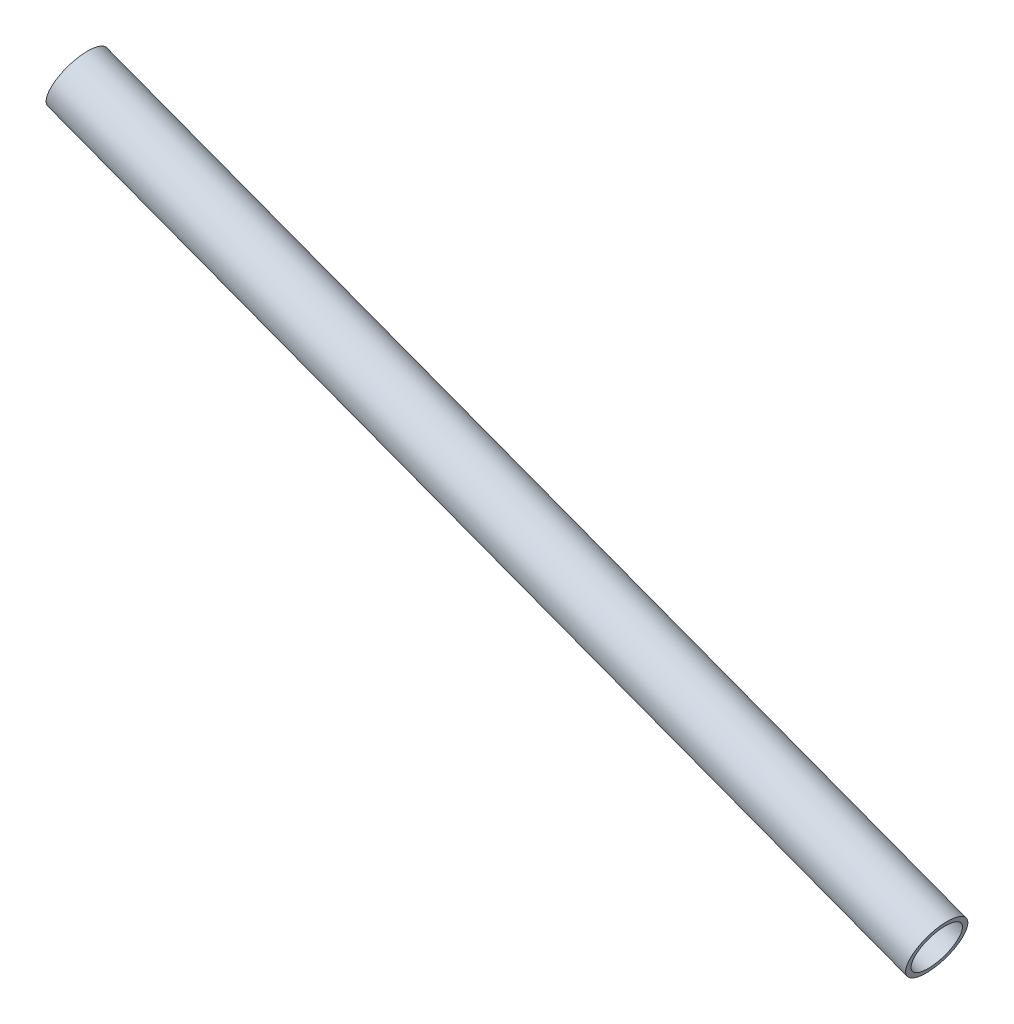
ISO-10303-21;
HEADER;
FILE_DESCRIPTION(('STEP AP214'),'2;1');
FILE_NAME('part.step','',(''),(''),'','','');
FILE_SCHEMA(('AUTOMOTIVE_DESIGN { 1 0 10303 214 1 1 1 1 }'));
ENDSEC;
DATA;
#1=APPLICATION_CONTEXT('core data for automotive mechanical design processes');
#2=APPLICATION_PROTOCOL_DEFINITION('international standard','automotive_design',2000,#1);
#3=PRODUCT_CONTEXT('',#1,'mechanical');
#4=PRODUCT('Part','Part','',(#3));
#5=PRODUCT_RELATED_PRODUCT_CATEGORY('part','',(#4));
#6=PRODUCT_DEFINITION_FORMATION('','',#4);
#7=PRODUCT_DEFINITION_CONTEXT('part definition',#1,'design');
#8=PRODUCT_DEFINITION('design','',#6,#7);
#9=PRODUCT_DEFINITION_SHAPE('','',#8);
#10=(LENGTH_UNIT() NAMED_UNIT(*) SI_UNIT(.MILLI.,.METRE.));
#11=(NAMED_UNIT(*) PLANE_ANGLE_UNIT() SI_UNIT($,.RADIAN.));
#12=(NAMED_UNIT(*) SI_UNIT($,.STERADIAN.) SOLID_ANGLE_UNIT());
#13=UNCERTAINTY_MEASURE_WITH_UNIT(LENGTH_MEASURE(1.E-05),#10,'distance_accuracy_value','');
#14=(GEOMETRIC_REPRESENTATION_CONTEXT(3) GLOBAL_UNCERTAINTY_ASSIGNED_CONTEXT((#13)) GLOBAL_UNIT_ASSIGNED_CONTEXT((#10,
#11,#12)) REPRESENTATION_CONTEXT('',''));
#15=CARTESIAN_POINT('',(0.,0.,0.));
#16=DIRECTION('',(0.,0.,1.));
#17=DIRECTION('',(1.,0.,0.));
#18=AXIS2_PLACEMENT_3D('',#15,#16,#17);
#19=CARTESIAN_POINT('',(-239.327268062547,-1717.21161045022,0.));
#20=DIRECTION('',(-0.935742740173775,0.352683320008296,0.));
#21=DIRECTION('',(-0.352683320008297,-0.935742740173775,0.));
#22=AXIS2_PLACEMENT_3D('',#19,#20,#21);
#23=PLANE('',#22);
#24=CARTESIAN_POINT('',(-236.550239600802,-1709.84357211409,0.));
#25=DIRECTION('',(0.935742740173775,-0.352683320008296,0.));
#26=DIRECTION('',(0.352683320008297,0.935742740173775,0.));
#27=AXIS2_PLACEMENT_3D('',#24,#25,#26);
#28=CIRCLE('',#27,7.874);
#29=CARTESIAN_POINT('',(-233.773211139057,-1702.47553377796,0.));
#30=VERTEX_POINT('',#29);
#31=EDGE_CURVE('E46',#30,#30,#28,.T.);
#32=ORIENTED_EDGE('',*,*,#31,.F.);
#33=EDGE_LOOP('',(#32));
#34=FACE_BOUND('',#33,.T.);
#35=CARTESIAN_POINT('',(-236.550239600802,-1709.84357211409,0.));
#36=DIRECTION('',(0.935742740173775,-0.352683320008296,0.));
#37=DIRECTION('',(0.352683320008297,0.935742740173775,0.));
#38=AXIS2_PLACEMENT_3D('',#35,#36,#37);
#39=CIRCLE('',#38,9.52500000000001);
#40=CARTESIAN_POINT('',(-233.190930977723,-1700.93062251394,0.));
#41=VERTEX_POINT('',#40);
#42=EDGE_CURVE('E10',#41,#41,#39,.T.);
#43=ORIENTED_EDGE('',*,*,#42,.T.);
#44=EDGE_LOOP('',(#43));
#45=FACE_BOUND('',#44,.T.);
#46=ADVANCED_FACE('F32',(#34,#45),#23,.F.);
#47=CARTESIAN_POINT('',(-236.550239600802,-1709.84357211409,0.));
#48=DIRECTION('',(0.935742740173775,-0.352683320008296,0.));
#49=DIRECTION('',(0.352683320008297,0.935742740173775,0.));
#50=AXIS2_PLACEMENT_3D('',#47,#48,#49);
#51=CYLINDRICAL_SURFACE('',#50,9.52499999999999);
#52=ORIENTED_EDGE('',*,*,#42,.F.);
#53=EDGE_LOOP('',(#52));
#54=FACE_BOUND('',#53,.T.);
#55=CARTESIAN_POINT('',(-515.288997855021,-1604.78637374584,0.));
#56=DIRECTION('',(0.935742740173775,-0.352683320008296,0.));
#57=DIRECTION('',(0.352683320008297,0.935742740173775,0.));
#58=AXIS2_PLACEMENT_3D('',#55,#56,#57);
#59=CIRCLE('',#58,9.52500000000002);
#60=CARTESIAN_POINT('',(-511.929689231942,-1595.87342414569,0.));
#61=VERTEX_POINT('',#60);
#62=EDGE_CURVE('E38',#61,#61,#59,.T.);
#63=ORIENTED_EDGE('',*,*,#62,.T.);
#64=EDGE_LOOP('',(#63));
#65=FACE_BOUND('',#64,.T.);
#66=ADVANCED_FACE('F55',(#54,#65),#51,.T.);
#67=CARTESIAN_POINT('',(-518.6483064781,-1613.699323346,0.));
#68=DIRECTION('',(0.935742740173775,-0.352683320008296,0.));
#69=DIRECTION('',(0.352683320008297,0.935742740173775,0.));
#70=AXIS2_PLACEMENT_3D('',#67,#68,#69);
#71=PLANE('',#70);
#72=ORIENTED_EDGE('',*,*,#62,.F.);
#73=EDGE_LOOP('',(#72));
#74=FACE_BOUND('',#73,.T.);
#75=CARTESIAN_POINT('',(-515.288997855021,-1604.78637374584,0.));
#76=DIRECTION('',(0.935742740173775,-0.352683320008296,0.));
#77=DIRECTION('',(0.352683320008297,0.935742740173775,0.));
#78=AXIS2_PLACEMENT_3D('',#75,#76,#77);
#79=CIRCLE('',#78,7.87400000000005);
#80=CARTESIAN_POINT('',(-512.511969393276,-1597.41833540971,0.));
#81=VERTEX_POINT('',#80);
#82=EDGE_CURVE('E42',#81,#81,#79,.T.);
#83=ORIENTED_EDGE('',*,*,#82,.T.);
#84=EDGE_LOOP('',(#83));
#85=FACE_BOUND('',#84,.T.);
#86=ADVANCED_FACE('F59',(#74,#85),#71,.F.);
#87=CARTESIAN_POINT('',(-236.550239600802,-1709.84357211409,0.));
#88=DIRECTION('',(0.935742740173775,-0.352683320008296,0.));
#89=DIRECTION('',(0.352683320008297,0.935742740173775,0.));
#90=AXIS2_PLACEMENT_3D('',#87,#88,#89);
#91=CYLINDRICAL_SURFACE('',#90,7.874);
#92=ORIENTED_EDGE('',*,*,#82,.F.);
#93=EDGE_LOOP('',(#92));
#94=FACE_BOUND('',#93,.T.);
#95=ORIENTED_EDGE('',*,*,#31,.T.);
#96=EDGE_LOOP('',(#95));
#97=FACE_BOUND('',#96,.T.);
#98=ADVANCED_FACE('F52',(#94,#97),#91,.F.);
#99=CLOSED_SHELL('',(#46,#66,#86,#98));
#100=MANIFOLD_SOLID_BREP('B2',#99);
#101=ADVANCED_BREP_SHAPE_REPRESENTATION('',(#18,#100),#14);
#102=SHAPE_DEFINITION_REPRESENTATION(#9,#101);
ENDSEC;
END-ISO-10303-21;
